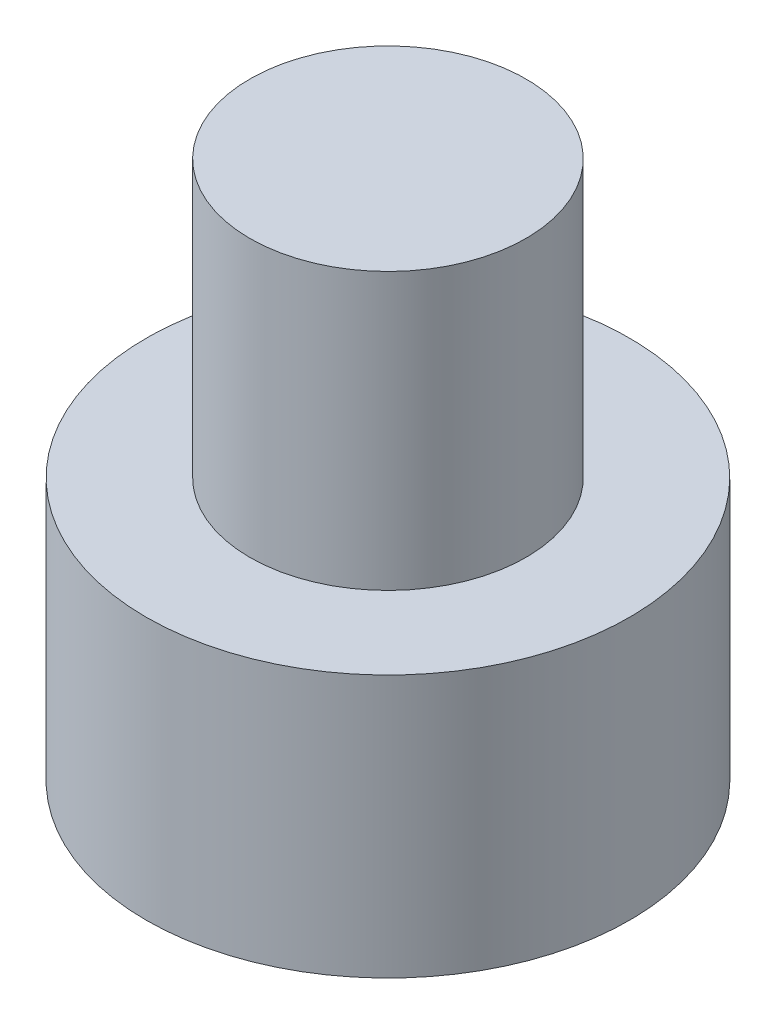
ISO-10303-21;
HEADER;
FILE_DESCRIPTION(('STEP AP214'),'2;1');
FILE_NAME('part.step','',(''),(''),'','','');
FILE_SCHEMA(('AUTOMOTIVE_DESIGN { 1 0 10303 214 1 1 1 1 }'));
ENDSEC;
DATA;
#1=APPLICATION_CONTEXT('core data for automotive mechanical design processes');
#2=APPLICATION_PROTOCOL_DEFINITION('international standard','automotive_design',2000,#1);
#3=PRODUCT_CONTEXT('',#1,'mechanical');
#4=PRODUCT('Part','Part','',(#3));
#5=PRODUCT_RELATED_PRODUCT_CATEGORY('part','',(#4));
#6=PRODUCT_DEFINITION_FORMATION('','',#4);
#7=PRODUCT_DEFINITION_CONTEXT('part definition',#1,'design');
#8=PRODUCT_DEFINITION('design','',#6,#7);
#9=PRODUCT_DEFINITION_SHAPE('','',#8);
#10=(LENGTH_UNIT() NAMED_UNIT(*) SI_UNIT(.MILLI.,.METRE.));
#11=(NAMED_UNIT(*) PLANE_ANGLE_UNIT() SI_UNIT($,.RADIAN.));
#12=(NAMED_UNIT(*) SI_UNIT($,.STERADIAN.) SOLID_ANGLE_UNIT());
#13=UNCERTAINTY_MEASURE_WITH_UNIT(LENGTH_MEASURE(1.E-05),#10,'distance_accuracy_value','');
#14=(GEOMETRIC_REPRESENTATION_CONTEXT(3) GLOBAL_UNCERTAINTY_ASSIGNED_CONTEXT((#13)) GLOBAL_UNIT_ASSIGNED_CONTEXT((#10,
#11,#12)) REPRESENTATION_CONTEXT('',''));
#15=CARTESIAN_POINT('',(0.,0.,0.));
#16=DIRECTION('',(0.,0.,1.));
#17=DIRECTION('',(1.,0.,0.));
#18=AXIS2_PLACEMENT_3D('',#15,#16,#17);
#19=CARTESIAN_POINT('',(0.,-3.9,0.));
#20=DIRECTION('',(0.,1.,0.));
#21=DIRECTION('',(0.,0.,1.));
#22=AXIS2_PLACEMENT_3D('',#19,#20,#21);
#23=PLANE('',#22);
#24=CARTESIAN_POINT('',(0.,-3.9,0.));
#25=DIRECTION('',(0.,1.,0.));
#26=DIRECTION('',(0.,0.,1.));
#27=AXIS2_PLACEMENT_3D('',#24,#25,#26);
#28=CIRCLE('',#27,3.5);
#29=CARTESIAN_POINT('',(0.,-3.9,3.5));
#30=VERTEX_POINT('',#29);
#31=EDGE_CURVE('E10',#30,#30,#28,.T.);
#32=ORIENTED_EDGE('',*,*,#31,.F.);
#33=EDGE_LOOP('',(#32));
#34=FACE_BOUND('',#33,.T.);
#35=ADVANCED_FACE('F31',(#34),#23,.F.);
#36=CARTESIAN_POINT('',(0.,3.9,0.));
#37=DIRECTION('',(0.,1.,0.));
#38=DIRECTION('',(0.,0.,1.));
#39=AXIS2_PLACEMENT_3D('',#36,#37,#38);
#40=CYLINDRICAL_SURFACE('',#39,3.5);
#41=CARTESIAN_POINT('',(0.,-0.100000000000001,0.));
#42=DIRECTION('',(0.,1.,0.));
#43=DIRECTION('',(0.,0.,1.));
#44=AXIS2_PLACEMENT_3D('',#41,#42,#43);
#45=CIRCLE('',#44,3.5);
#46=CARTESIAN_POINT('',(0.,-0.100000000000001,3.5));
#47=VERTEX_POINT('',#46);
#48=EDGE_CURVE('E37',#47,#47,#45,.T.);
#49=ORIENTED_EDGE('',*,*,#48,.F.);
#50=EDGE_LOOP('',(#49));
#51=FACE_BOUND('',#50,.T.);
#52=ORIENTED_EDGE('',*,*,#31,.T.);
#53=EDGE_LOOP('',(#52));
#54=FACE_BOUND('',#53,.T.);
#55=ADVANCED_FACE('F61',(#51,#54),#40,.T.);
#56=CARTESIAN_POINT('',(3.5,-0.100000000000001,0.));
#57=DIRECTION('',(0.,-1.,0.));
#58=DIRECTION('',(0.,0.,-1.));
#59=AXIS2_PLACEMENT_3D('',#56,#57,#58);
#60=PLANE('',#59);
#61=CARTESIAN_POINT('',(0.,-0.1,0.));
#62=DIRECTION('',(0.,1.,0.));
#63=DIRECTION('',(0.,0.,1.));
#64=AXIS2_PLACEMENT_3D('',#61,#62,#63);
#65=CIRCLE('',#64,2.);
#66=CARTESIAN_POINT('',(0.,-0.1,2.));
#67=VERTEX_POINT('',#66);
#68=EDGE_CURVE('E41',#67,#67,#65,.T.);
#69=ORIENTED_EDGE('',*,*,#68,.F.);
#70=EDGE_LOOP('',(#69));
#71=FACE_BOUND('',#70,.T.);
#72=ORIENTED_EDGE('',*,*,#48,.T.);
#73=EDGE_LOOP('',(#72));
#74=FACE_BOUND('',#73,.T.);
#75=ADVANCED_FACE('F56',(#71,#74),#60,.F.);
#76=CARTESIAN_POINT('',(0.,3.9,0.));
#77=DIRECTION('',(0.,1.,0.));
#78=DIRECTION('',(0.,0.,1.));
#79=AXIS2_PLACEMENT_3D('',#76,#77,#78);
#80=CYLINDRICAL_SURFACE('',#79,2.);
#81=CARTESIAN_POINT('',(0.,3.9,0.));
#82=DIRECTION('',(0.,1.,0.));
#83=DIRECTION('',(0.,0.,1.));
#84=AXIS2_PLACEMENT_3D('',#81,#82,#83);
#85=CIRCLE('',#84,2.);
#86=CARTESIAN_POINT('',(0.,3.9,2.));
#87=VERTEX_POINT('',#86);
#88=EDGE_CURVE('E45',#87,#87,#85,.T.);
#89=ORIENTED_EDGE('',*,*,#88,.F.);
#90=EDGE_LOOP('',(#89));
#91=FACE_BOUND('',#90,.T.);
#92=ORIENTED_EDGE('',*,*,#68,.T.);
#93=EDGE_LOOP('',(#92));
#94=FACE_BOUND('',#93,.T.);
#95=ADVANCED_FACE('F53',(#91,#94),#80,.T.);
#96=CARTESIAN_POINT('',(2.,3.9,0.));
#97=DIRECTION('',(0.,-1.,0.));
#98=DIRECTION('',(0.,0.,-1.));
#99=AXIS2_PLACEMENT_3D('',#96,#97,#98);
#100=PLANE('',#99);
#101=ORIENTED_EDGE('',*,*,#88,.T.);
#102=EDGE_LOOP('',(#101));
#103=FACE_BOUND('',#102,.T.);
#104=ADVANCED_FACE('F51',(#103),#100,.F.);
#105=CLOSED_SHELL('',(#35,#55,#75,#95,#104));
#106=MANIFOLD_SOLID_BREP('B2',#105);
#107=ADVANCED_BREP_SHAPE_REPRESENTATION('',(#18,#106),#14);
#108=SHAPE_DEFINITION_REPRESENTATION(#9,#107);
ENDSEC;
END-ISO-10303-21;
